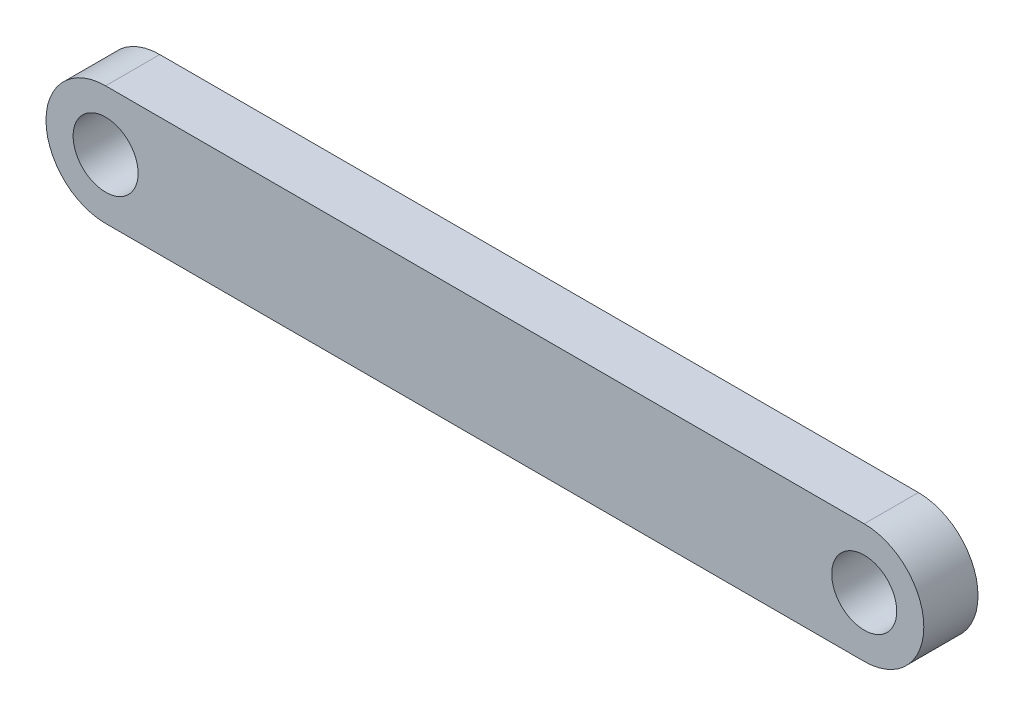
ISO-10303-21;
HEADER;
FILE_DESCRIPTION(('STEP AP214'),'2;1');
FILE_NAME('part.step','',(''),(''),'','','');
FILE_SCHEMA(('AUTOMOTIVE_DESIGN { 1 0 10303 214 1 1 1 1 }'));
ENDSEC;
DATA;
#1=APPLICATION_CONTEXT('core data for automotive mechanical design processes');
#2=APPLICATION_PROTOCOL_DEFINITION('international standard','automotive_design',2000,#1);
#3=PRODUCT_CONTEXT('',#1,'mechanical');
#4=PRODUCT('Part','Part','',(#3));
#5=PRODUCT_RELATED_PRODUCT_CATEGORY('part','',(#4));
#6=PRODUCT_DEFINITION_FORMATION('','',#4);
#7=PRODUCT_DEFINITION_CONTEXT('part definition',#1,'design');
#8=PRODUCT_DEFINITION('design','',#6,#7);
#9=PRODUCT_DEFINITION_SHAPE('','',#8);
#10=(LENGTH_UNIT() NAMED_UNIT(*) SI_UNIT(.MILLI.,.METRE.));
#11=(NAMED_UNIT(*) PLANE_ANGLE_UNIT() SI_UNIT($,.RADIAN.));
#12=(NAMED_UNIT(*) SI_UNIT($,.STERADIAN.) SOLID_ANGLE_UNIT());
#13=UNCERTAINTY_MEASURE_WITH_UNIT(LENGTH_MEASURE(1.E-05),#10,'distance_accuracy_value','');
#14=(GEOMETRIC_REPRESENTATION_CONTEXT(3) GLOBAL_UNCERTAINTY_ASSIGNED_CONTEXT((#13)) GLOBAL_UNIT_ASSIGNED_CONTEXT((#10,
#11,#12)) REPRESENTATION_CONTEXT('',''));
#15=CARTESIAN_POINT('',(0.,0.,0.));
#16=DIRECTION('',(0.,0.,1.));
#17=DIRECTION('',(1.,0.,0.));
#18=AXIS2_PLACEMENT_3D('',#15,#16,#17);
#19=CARTESIAN_POINT('',(35.,0.,2.5));
#20=DIRECTION('',(0.,0.,1.));
#21=DIRECTION('',(1.,0.,0.));
#22=AXIS2_PLACEMENT_3D('',#19,#20,#21);
#23=PLANE('',#22);
#24=CARTESIAN_POINT('',(35.,0.,2.5));
#25=DIRECTION('',(0.,0.,1.));
#26=DIRECTION('',(1.,0.,0.));
#27=AXIS2_PLACEMENT_3D('',#24,#25,#26);
#28=CIRCLE('',#27,3.);
#29=CARTESIAN_POINT('',(38.,0.,2.5));
#30=VERTEX_POINT('',#29);
#31=EDGE_CURVE('E103',#30,#30,#28,.T.);
#32=ORIENTED_EDGE('',*,*,#31,.F.);
#33=EDGE_LOOP('',(#32));
#34=FACE_BOUND('',#33,.T.);
#35=CARTESIAN_POINT('',(35.,0.,2.5));
#36=DIRECTION('',(0.,0.,1.));
#37=DIRECTION('',(1.,0.,0.));
#38=AXIS2_PLACEMENT_3D('',#35,#36,#37);
#39=CIRCLE('',#38,5.5);
#40=CARTESIAN_POINT('',(35.,-5.50000000000001,2.5));
#41=VERTEX_POINT('',#40);
#42=CARTESIAN_POINT('',(35.,5.49999999999999,2.5));
#43=VERTEX_POINT('',#42);
#44=EDGE_CURVE('E88',#41,#43,#39,.T.);
#45=ORIENTED_EDGE('',*,*,#44,.T.);
#46=DIRECTION('',(-1.,0.,0.));
#47=VECTOR('',#46,1.);
#48=CARTESIAN_POINT('',(35.,5.49999999999999,2.5));
#49=LINE('',#48,#47);
#50=CARTESIAN_POINT('',(-35.,5.50000000000001,2.5));
#51=VERTEX_POINT('',#50);
#52=EDGE_CURVE('E83',#43,#51,#49,.T.);
#53=ORIENTED_EDGE('',*,*,#52,.T.);
#54=CARTESIAN_POINT('',(-35.,0.,2.5));
#55=DIRECTION('',(0.,0.,1.));
#56=DIRECTION('',(1.,0.,0.));
#57=AXIS2_PLACEMENT_3D('',#54,#55,#56);
#58=CIRCLE('',#57,5.5);
#59=CARTESIAN_POINT('',(-35.,-5.50000000000002,2.5));
#60=VERTEX_POINT('',#59);
#61=EDGE_CURVE('E86',#51,#60,#58,.T.);
#62=ORIENTED_EDGE('',*,*,#61,.T.);
#63=DIRECTION('',(1.,0.,0.));
#64=VECTOR('',#63,1.);
#65=CARTESIAN_POINT('',(35.,-5.50000000000001,2.5));
#66=LINE('',#65,#64);
#67=EDGE_CURVE('E53',#60,#41,#66,.T.);
#68=ORIENTED_EDGE('',*,*,#67,.T.);
#69=EDGE_LOOP('',(#45,#53,#62,#68));
#70=FACE_BOUND('',#69,.T.);
#71=CARTESIAN_POINT('',(-35.,0.,2.5));
#72=DIRECTION('',(0.,0.,1.));
#73=DIRECTION('',(1.,0.,0.));
#74=AXIS2_PLACEMENT_3D('',#71,#72,#73);
#75=CIRCLE('',#74,3.);
#76=CARTESIAN_POINT('',(-32.,0.,2.5));
#77=VERTEX_POINT('',#76);
#78=EDGE_CURVE('E118',#77,#77,#75,.T.);
#79=ORIENTED_EDGE('',*,*,#78,.F.);
#80=EDGE_LOOP('',(#79));
#81=FACE_BOUND('',#80,.T.);
#82=ADVANCED_FACE('F36',(#34,#70,#81),#23,.T.);
#83=CARTESIAN_POINT('',(35.,0.,-2.5));
#84=DIRECTION('',(0.,0.,1.));
#85=DIRECTION('',(1.,0.,0.));
#86=AXIS2_PLACEMENT_3D('',#83,#84,#85);
#87=PLANE('',#86);
#88=CARTESIAN_POINT('',(35.,0.,-2.5));
#89=DIRECTION('',(0.,0.,1.));
#90=DIRECTION('',(1.,0.,0.));
#91=AXIS2_PLACEMENT_3D('',#88,#89,#90);
#92=CIRCLE('',#91,5.5);
#93=CARTESIAN_POINT('',(35.,-5.50000000000001,-2.5));
#94=VERTEX_POINT('',#93);
#95=CARTESIAN_POINT('',(35.,5.49999999999999,-2.5));
#96=VERTEX_POINT('',#95);
#97=EDGE_CURVE('E100',#94,#96,#92,.T.);
#98=ORIENTED_EDGE('',*,*,#97,.F.);
#99=DIRECTION('',(1.,0.,0.));
#100=VECTOR('',#99,1.);
#101=CARTESIAN_POINT('',(35.,-5.50000000000001,-2.5));
#102=LINE('',#101,#100);
#103=CARTESIAN_POINT('',(-35.,-5.50000000000002,-2.5));
#104=VERTEX_POINT('',#103);
#105=EDGE_CURVE('E76',#104,#94,#102,.T.);
#106=ORIENTED_EDGE('',*,*,#105,.F.);
#107=CARTESIAN_POINT('',(-35.,0.,-2.5));
#108=DIRECTION('',(0.,0.,1.));
#109=DIRECTION('',(1.,0.,0.));
#110=AXIS2_PLACEMENT_3D('',#107,#108,#109);
#111=CIRCLE('',#110,5.5);
#112=CARTESIAN_POINT('',(-35.,5.50000000000001,-2.5));
#113=VERTEX_POINT('',#112);
#114=EDGE_CURVE('E70',#113,#104,#111,.T.);
#115=ORIENTED_EDGE('',*,*,#114,.F.);
#116=DIRECTION('',(-1.,0.,0.));
#117=VECTOR('',#116,1.);
#118=CARTESIAN_POINT('',(35.,5.49999999999999,-2.5));
#119=LINE('',#118,#117);
#120=EDGE_CURVE('E92',#96,#113,#119,.T.);
#121=ORIENTED_EDGE('',*,*,#120,.F.);
#122=EDGE_LOOP('',(#98,#106,#115,#121));
#123=FACE_BOUND('',#122,.T.);
#124=CARTESIAN_POINT('',(35.,0.,-2.5));
#125=DIRECTION('',(0.,0.,1.));
#126=DIRECTION('',(1.,0.,0.));
#127=AXIS2_PLACEMENT_3D('',#124,#125,#126);
#128=CIRCLE('',#127,3.);
#129=CARTESIAN_POINT('',(38.,0.,-2.5));
#130=VERTEX_POINT('',#129);
#131=EDGE_CURVE('E115',#130,#130,#128,.T.);
#132=ORIENTED_EDGE('',*,*,#131,.T.);
#133=EDGE_LOOP('',(#132));
#134=FACE_BOUND('',#133,.T.);
#135=CARTESIAN_POINT('',(-35.,0.,-2.5));
#136=DIRECTION('',(0.,0.,1.));
#137=DIRECTION('',(1.,0.,0.));
#138=AXIS2_PLACEMENT_3D('',#135,#136,#137);
#139=CIRCLE('',#138,3.);
#140=CARTESIAN_POINT('',(-32.,0.,-2.5));
#141=VERTEX_POINT('',#140);
#142=EDGE_CURVE('E121',#141,#141,#139,.T.);
#143=ORIENTED_EDGE('',*,*,#142,.T.);
#144=EDGE_LOOP('',(#143));
#145=FACE_BOUND('',#144,.T.);
#146=ADVANCED_FACE('F111',(#123,#134,#145),#87,.F.);
#147=CARTESIAN_POINT('',(35.,0.,2.5));
#148=DIRECTION('',(0.,0.,-1.));
#149=DIRECTION('',(-1.,0.,0.));
#150=AXIS2_PLACEMENT_3D('',#147,#148,#149);
#151=CYLINDRICAL_SURFACE('',#150,5.5);
#152=ORIENTED_EDGE('',*,*,#97,.T.);
#153=DIRECTION('',(0.,0.,-1.));
#154=VECTOR('',#153,1.);
#155=CARTESIAN_POINT('',(35.,5.49999999999999,2.5));
#156=LINE('',#155,#154);
#157=EDGE_CURVE('E11',#43,#96,#156,.T.);
#158=ORIENTED_EDGE('',*,*,#157,.F.);
#159=ORIENTED_EDGE('',*,*,#44,.F.);
#160=DIRECTION('',(0.,0.,-1.));
#161=VECTOR('',#160,1.);
#162=CARTESIAN_POINT('',(35.,-5.50000000000001,2.5));
#163=LINE('',#162,#161);
#164=EDGE_CURVE('E96',#41,#94,#163,.T.);
#165=ORIENTED_EDGE('',*,*,#164,.T.);
#166=EDGE_LOOP('',(#152,#158,#159,#165));
#167=FACE_BOUND('',#166,.T.);
#168=ADVANCED_FACE('F38',(#167),#151,.T.);
#169=CARTESIAN_POINT('',(35.,5.49999999999999,2.5));
#170=DIRECTION('',(0.,-1.,0.));
#171=DIRECTION('',(1.,0.,0.));
#172=AXIS2_PLACEMENT_3D('',#169,#170,#171);
#173=PLANE('',#172);
#174=ORIENTED_EDGE('',*,*,#120,.T.);
#175=DIRECTION('',(0.,0.,-1.));
#176=VECTOR('',#175,1.);
#177=CARTESIAN_POINT('',(-35.,5.50000000000001,2.5));
#178=LINE('',#177,#176);
#179=EDGE_CURVE('E45',#51,#113,#178,.T.);
#180=ORIENTED_EDGE('',*,*,#179,.F.);
#181=ORIENTED_EDGE('',*,*,#52,.F.);
#182=ORIENTED_EDGE('',*,*,#157,.T.);
#183=EDGE_LOOP('',(#174,#180,#181,#182));
#184=FACE_BOUND('',#183,.T.);
#185=ADVANCED_FACE('F91',(#184),#173,.F.);
#186=CARTESIAN_POINT('',(-35.,0.,2.5));
#187=DIRECTION('',(0.,0.,-1.));
#188=DIRECTION('',(-1.,0.,0.));
#189=AXIS2_PLACEMENT_3D('',#186,#187,#188);
#190=CYLINDRICAL_SURFACE('',#189,5.5);
#191=ORIENTED_EDGE('',*,*,#114,.T.);
#192=DIRECTION('',(0.,0.,-1.));
#193=VECTOR('',#192,1.);
#194=CARTESIAN_POINT('',(-35.,-5.50000000000002,2.5));
#195=LINE('',#194,#193);
#196=EDGE_CURVE('E93',#60,#104,#195,.T.);
#197=ORIENTED_EDGE('',*,*,#196,.F.);
#198=ORIENTED_EDGE('',*,*,#61,.F.);
#199=ORIENTED_EDGE('',*,*,#179,.T.);
#200=EDGE_LOOP('',(#191,#197,#198,#199));
#201=FACE_BOUND('',#200,.T.);
#202=ADVANCED_FACE('F94',(#201),#190,.T.);
#203=CARTESIAN_POINT('',(35.,-5.50000000000001,2.5));
#204=DIRECTION('',(0.,1.,0.));
#205=DIRECTION('',(-1.,0.,0.));
#206=AXIS2_PLACEMENT_3D('',#203,#204,#205);
#207=PLANE('',#206);
#208=ORIENTED_EDGE('',*,*,#105,.T.);
#209=ORIENTED_EDGE('',*,*,#164,.F.);
#210=ORIENTED_EDGE('',*,*,#67,.F.);
#211=ORIENTED_EDGE('',*,*,#196,.T.);
#212=EDGE_LOOP('',(#208,#209,#210,#211));
#213=FACE_BOUND('',#212,.T.);
#214=ADVANCED_FACE('F108',(#213),#207,.F.);
#215=CARTESIAN_POINT('',(35.,0.,2.5));
#216=DIRECTION('',(0.,0.,-1.));
#217=DIRECTION('',(-1.,0.,0.));
#218=AXIS2_PLACEMENT_3D('',#215,#216,#217);
#219=CYLINDRICAL_SURFACE('',#218,3.);
#220=ORIENTED_EDGE('',*,*,#31,.T.);
#221=EDGE_LOOP('',(#220));
#222=FACE_BOUND('',#221,.T.);
#223=ORIENTED_EDGE('',*,*,#131,.F.);
#224=EDGE_LOOP('',(#223));
#225=FACE_BOUND('',#224,.T.);
#226=ADVANCED_FACE('F138',(#222,#225),#219,.F.);
#227=CARTESIAN_POINT('',(-35.,0.,2.5));
#228=DIRECTION('',(0.,0.,-1.));
#229=DIRECTION('',(-1.,0.,0.));
#230=AXIS2_PLACEMENT_3D('',#227,#228,#229);
#231=CYLINDRICAL_SURFACE('',#230,3.);
#232=ORIENTED_EDGE('',*,*,#78,.T.);
#233=EDGE_LOOP('',(#232));
#234=FACE_BOUND('',#233,.T.);
#235=ORIENTED_EDGE('',*,*,#142,.F.);
#236=EDGE_LOOP('',(#235));
#237=FACE_BOUND('',#236,.T.);
#238=ADVANCED_FACE('F127',(#234,#237),#231,.F.);
#239=CLOSED_SHELL('',(#82,#146,#168,#185,#202,#214,#226,#238));
#240=MANIFOLD_SOLID_BREP('B2',#239);
#241=ADVANCED_BREP_SHAPE_REPRESENTATION('',(#18,#240),#14);
#242=SHAPE_DEFINITION_REPRESENTATION(#9,#241);
ENDSEC;
END-ISO-10303-21;
